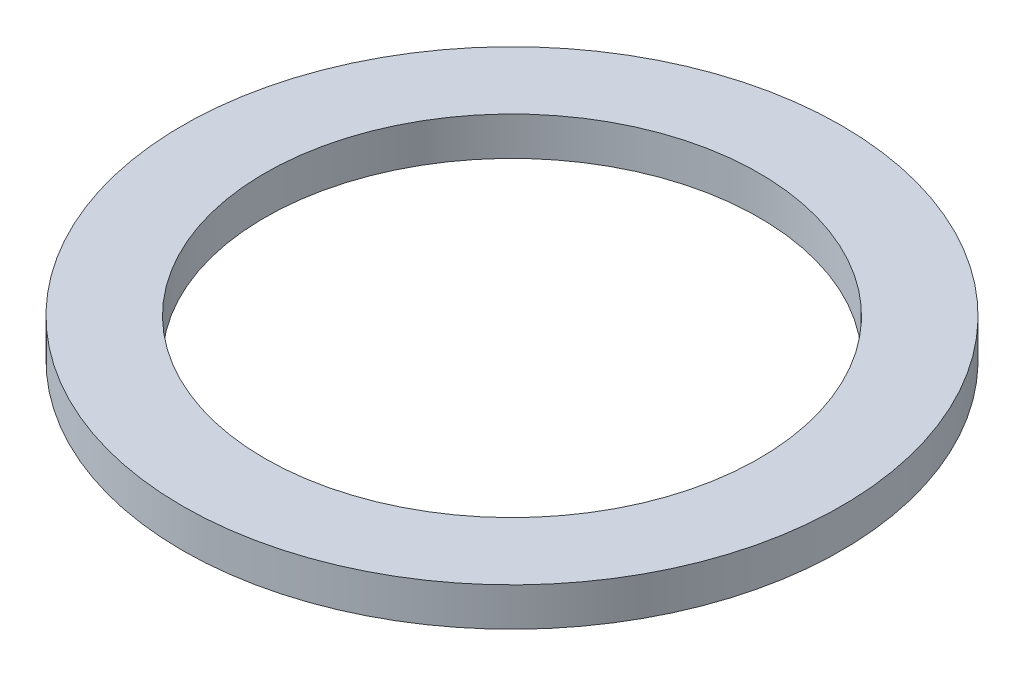
ISO-10303-21;
HEADER;
FILE_DESCRIPTION(('STEP AP214'),'2;1');
FILE_NAME('part.step','',(''),(''),'','','');
FILE_SCHEMA(('AUTOMOTIVE_DESIGN { 1 0 10303 214 1 1 1 1 }'));
ENDSEC;
DATA;
#1=APPLICATION_CONTEXT('core data for automotive mechanical design processes');
#2=APPLICATION_PROTOCOL_DEFINITION('international standard','automotive_design',2000,#1);
#3=PRODUCT_CONTEXT('',#1,'mechanical');
#4=PRODUCT('Part','Part','',(#3));
#5=PRODUCT_RELATED_PRODUCT_CATEGORY('part','',(#4));
#6=PRODUCT_DEFINITION_FORMATION('','',#4);
#7=PRODUCT_DEFINITION_CONTEXT('part definition',#1,'design');
#8=PRODUCT_DEFINITION('design','',#6,#7);
#9=PRODUCT_DEFINITION_SHAPE('','',#8);
#10=(LENGTH_UNIT() NAMED_UNIT(*) SI_UNIT(.MILLI.,.METRE.));
#11=(NAMED_UNIT(*) PLANE_ANGLE_UNIT() SI_UNIT($,.RADIAN.));
#12=(NAMED_UNIT(*) SI_UNIT($,.STERADIAN.) SOLID_ANGLE_UNIT());
#13=UNCERTAINTY_MEASURE_WITH_UNIT(LENGTH_MEASURE(1.E-05),#10,'distance_accuracy_value','');
#14=(GEOMETRIC_REPRESENTATION_CONTEXT(3) GLOBAL_UNCERTAINTY_ASSIGNED_CONTEXT((#13)) GLOBAL_UNIT_ASSIGNED_CONTEXT((#10,
#11,#12)) REPRESENTATION_CONTEXT('',''));
#15=CARTESIAN_POINT('',(0.,0.,0.));
#16=DIRECTION('',(0.,0.,1.));
#17=DIRECTION('',(1.,0.,0.));
#18=AXIS2_PLACEMENT_3D('',#15,#16,#17);
#19=CARTESIAN_POINT('',(0.,7.,0.));
#20=DIRECTION('',(0.,-1.,0.));
#21=DIRECTION('',(0.,0.,-1.));
#22=AXIS2_PLACEMENT_3D('',#19,#20,#21);
#23=CYLINDRICAL_SURFACE('',#22,60.);
#24=CARTESIAN_POINT('',(0.,7.,0.));
#25=DIRECTION('',(0.,1.,0.));
#26=DIRECTION('',(0.,0.,1.));
#27=AXIS2_PLACEMENT_3D('',#24,#25,#26);
#28=CIRCLE('',#27,60.);
#29=CARTESIAN_POINT('',(0.,7.,60.));
#30=VERTEX_POINT('',#29);
#31=EDGE_CURVE('E10',#30,#30,#28,.T.);
#32=ORIENTED_EDGE('',*,*,#31,.F.);
#33=EDGE_LOOP('',(#32));
#34=FACE_BOUND('',#33,.T.);
#35=CARTESIAN_POINT('',(0.,0.,0.));
#36=DIRECTION('',(0.,1.,0.));
#37=DIRECTION('',(0.,0.,1.));
#38=AXIS2_PLACEMENT_3D('',#35,#36,#37);
#39=CIRCLE('',#38,60.);
#40=CARTESIAN_POINT('',(0.,0.,60.));
#41=VERTEX_POINT('',#40);
#42=EDGE_CURVE('E37',#41,#41,#39,.T.);
#43=ORIENTED_EDGE('',*,*,#42,.T.);
#44=EDGE_LOOP('',(#43));
#45=FACE_BOUND('',#44,.T.);
#46=ADVANCED_FACE('F40',(#34,#45),#23,.T.);
#47=CARTESIAN_POINT('',(0.,7.,0.));
#48=DIRECTION('',(0.,1.,0.));
#49=DIRECTION('',(0.,0.,1.));
#50=AXIS2_PLACEMENT_3D('',#47,#48,#49);
#51=PLANE('',#50);
#52=CARTESIAN_POINT('',(0.,7.,0.));
#53=DIRECTION('',(0.,1.,0.));
#54=DIRECTION('',(0.,0.,1.));
#55=AXIS2_PLACEMENT_3D('',#52,#53,#54);
#56=CIRCLE('',#55,45.);
#57=CARTESIAN_POINT('',(0.,7.,45.));
#58=VERTEX_POINT('',#57);
#59=EDGE_CURVE('E50',#58,#58,#56,.T.);
#60=ORIENTED_EDGE('',*,*,#59,.F.);
#61=EDGE_LOOP('',(#60));
#62=FACE_BOUND('',#61,.T.);
#63=ORIENTED_EDGE('',*,*,#31,.T.);
#64=EDGE_LOOP('',(#63));
#65=FACE_BOUND('',#64,.T.);
#66=ADVANCED_FACE('F59',(#62,#65),#51,.T.);
#67=CARTESIAN_POINT('',(0.,0.,0.));
#68=DIRECTION('',(0.,1.,0.));
#69=DIRECTION('',(0.,0.,1.));
#70=AXIS2_PLACEMENT_3D('',#67,#68,#69);
#71=PLANE('',#70);
#72=CARTESIAN_POINT('',(0.,0.,0.));
#73=DIRECTION('',(0.,1.,0.));
#74=DIRECTION('',(0.,0.,1.));
#75=AXIS2_PLACEMENT_3D('',#72,#73,#74);
#76=CIRCLE('',#75,45.);
#77=CARTESIAN_POINT('',(0.,0.,45.));
#78=VERTEX_POINT('',#77);
#79=EDGE_CURVE('E47',#78,#78,#76,.T.);
#80=ORIENTED_EDGE('',*,*,#79,.T.);
#81=EDGE_LOOP('',(#80));
#82=FACE_BOUND('',#81,.T.);
#83=ORIENTED_EDGE('',*,*,#42,.F.);
#84=EDGE_LOOP('',(#83));
#85=FACE_BOUND('',#84,.T.);
#86=ADVANCED_FACE('F58',(#82,#85),#71,.F.);
#87=CARTESIAN_POINT('',(0.,7.,0.));
#88=DIRECTION('',(0.,-1.,0.));
#89=DIRECTION('',(0.,0.,-1.));
#90=AXIS2_PLACEMENT_3D('',#87,#88,#89);
#91=CYLINDRICAL_SURFACE('',#90,45.);
#92=ORIENTED_EDGE('',*,*,#59,.T.);
#93=EDGE_LOOP('',(#92));
#94=FACE_BOUND('',#93,.T.);
#95=ORIENTED_EDGE('',*,*,#79,.F.);
#96=EDGE_LOOP('',(#95));
#97=FACE_BOUND('',#96,.T.);
#98=ADVANCED_FACE('F54',(#94,#97),#91,.F.);
#99=CLOSED_SHELL('',(#46,#66,#86,#98));
#100=MANIFOLD_SOLID_BREP('B2',#99);
#101=ADVANCED_BREP_SHAPE_REPRESENTATION('',(#18,#100),#14);
#102=SHAPE_DEFINITION_REPRESENTATION(#9,#101);
ENDSEC;
END-ISO-10303-21;
